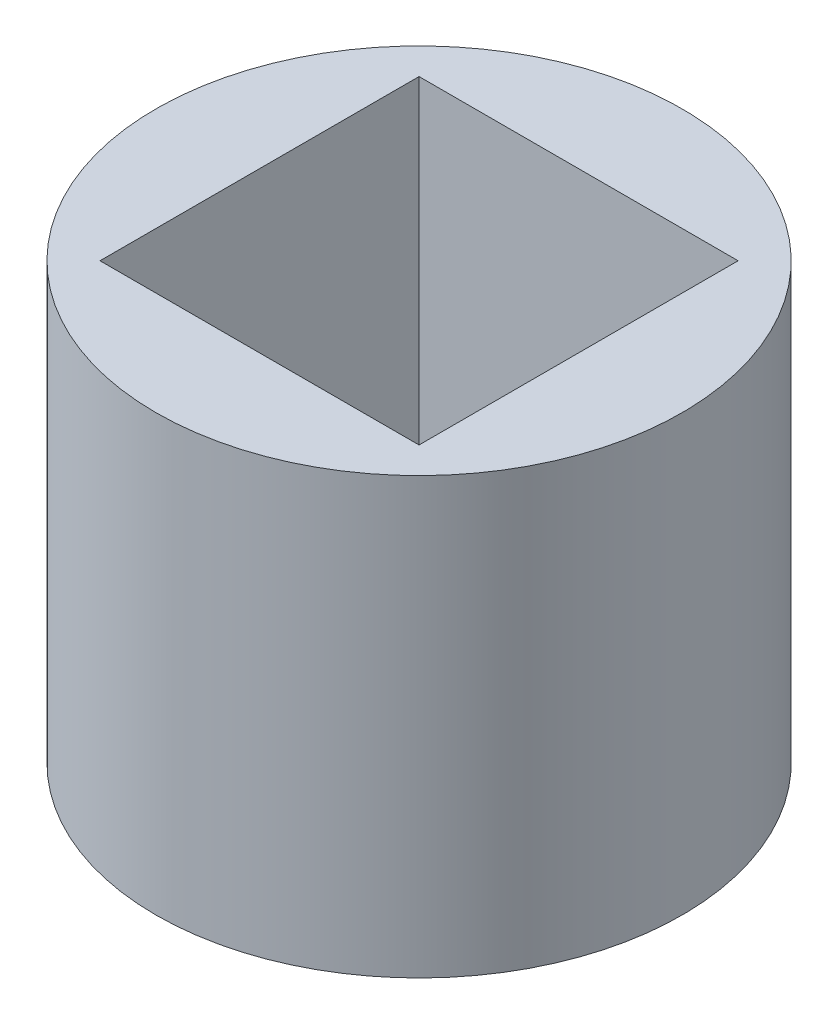
ISO-10303-21;
HEADER;
FILE_DESCRIPTION(('STEP AP214'),'2;1');
FILE_NAME('part.step','',(''),(''),'','','');
FILE_SCHEMA(('AUTOMOTIVE_DESIGN { 1 0 10303 214 1 1 1 1 }'));
ENDSEC;
DATA;
#1=APPLICATION_CONTEXT('core data for automotive mechanical design processes');
#2=APPLICATION_PROTOCOL_DEFINITION('international standard','automotive_design',2000,#1);
#3=PRODUCT_CONTEXT('',#1,'mechanical');
#4=PRODUCT('Part','Part','',(#3));
#5=PRODUCT_RELATED_PRODUCT_CATEGORY('part','',(#4));
#6=PRODUCT_DEFINITION_FORMATION('','',#4);
#7=PRODUCT_DEFINITION_CONTEXT('part definition',#1,'design');
#8=PRODUCT_DEFINITION('design','',#6,#7);
#9=PRODUCT_DEFINITION_SHAPE('','',#8);
#10=(LENGTH_UNIT() NAMED_UNIT(*) SI_UNIT(.MILLI.,.METRE.));
#11=(NAMED_UNIT(*) PLANE_ANGLE_UNIT() SI_UNIT($,.RADIAN.));
#12=(NAMED_UNIT(*) SI_UNIT($,.STERADIAN.) SOLID_ANGLE_UNIT());
#13=UNCERTAINTY_MEASURE_WITH_UNIT(LENGTH_MEASURE(1.E-05),#10,'distance_accuracy_value','');
#14=(GEOMETRIC_REPRESENTATION_CONTEXT(3) GLOBAL_UNCERTAINTY_ASSIGNED_CONTEXT((#13)) GLOBAL_UNIT_ASSIGNED_CONTEXT((#10,
#11,#12)) REPRESENTATION_CONTEXT('',''));
#15=CARTESIAN_POINT('',(0.,0.,0.));
#16=DIRECTION('',(0.,0.,1.));
#17=DIRECTION('',(1.,0.,0.));
#18=AXIS2_PLACEMENT_3D('',#15,#16,#17);
#19=CARTESIAN_POINT('',(0.,21.,0.));
#20=DIRECTION('',(0.,1.,0.));
#21=DIRECTION('',(0.,0.,1.));
#22=AXIS2_PLACEMENT_3D('',#19,#20,#21);
#23=PLANE('',#22);
#24=CARTESIAN_POINT('',(0.,21.,0.));
#25=DIRECTION('',(0.,1.,0.));
#26=DIRECTION('',(0.,0.,1.));
#27=AXIS2_PLACEMENT_3D('',#24,#25,#26);
#28=CIRCLE('',#27,12.7);
#29=CARTESIAN_POINT('',(0.,21.,12.7));
#30=VERTEX_POINT('',#29);
#31=EDGE_CURVE('E11',#30,#30,#28,.T.);
#32=ORIENTED_EDGE('',*,*,#31,.T.);
#33=EDGE_LOOP('',(#32));
#34=FACE_BOUND('',#33,.T.);
#35=DIRECTION('',(-1.,0.,0.));
#36=VECTOR('',#35,1.);
#37=CARTESIAN_POINT('',(-7.7,21.,-7.7));
#38=LINE('',#37,#36);
#39=CARTESIAN_POINT('',(7.7,21.,-7.7));
#40=VERTEX_POINT('',#39);
#41=CARTESIAN_POINT('',(-7.7,21.,-7.7));
#42=VERTEX_POINT('',#41);
#43=EDGE_CURVE('E90',#40,#42,#38,.T.);
#44=ORIENTED_EDGE('',*,*,#43,.F.);
#45=DIRECTION('',(0.,0.,-1.));
#46=VECTOR('',#45,1.);
#47=CARTESIAN_POINT('',(7.7,21.,-7.7));
#48=LINE('',#47,#46);
#49=CARTESIAN_POINT('',(7.7,21.,7.7));
#50=VERTEX_POINT('',#49);
#51=EDGE_CURVE('E81',#50,#40,#48,.T.);
#52=ORIENTED_EDGE('',*,*,#51,.F.);
#53=DIRECTION('',(1.,0.,0.));
#54=VECTOR('',#53,1.);
#55=CARTESIAN_POINT('',(-7.7,21.,7.7));
#56=LINE('',#55,#54);
#57=CARTESIAN_POINT('',(-7.7,21.,7.7));
#58=VERTEX_POINT('',#57);
#59=EDGE_CURVE('E106',#58,#50,#56,.T.);
#60=ORIENTED_EDGE('',*,*,#59,.F.);
#61=DIRECTION('',(0.,0.,1.));
#62=VECTOR('',#61,1.);
#63=CARTESIAN_POINT('',(-7.7,21.,-7.7));
#64=LINE('',#63,#62);
#65=EDGE_CURVE('E102',#42,#58,#64,.T.);
#66=ORIENTED_EDGE('',*,*,#65,.F.);
#67=EDGE_LOOP('',(#44,#52,#60,#66));
#68=FACE_BOUND('',#67,.T.);
#69=ADVANCED_FACE('F39',(#34,#68),#23,.T.);
#70=CARTESIAN_POINT('',(0.,0.,0.));
#71=DIRECTION('',(0.,1.,0.));
#72=DIRECTION('',(0.,0.,1.));
#73=AXIS2_PLACEMENT_3D('',#70,#71,#72);
#74=PLANE('',#73);
#75=CARTESIAN_POINT('',(0.,0.,0.));
#76=DIRECTION('',(0.,1.,0.));
#77=DIRECTION('',(0.,0.,1.));
#78=AXIS2_PLACEMENT_3D('',#75,#76,#77);
#79=CIRCLE('',#78,12.7);
#80=CARTESIAN_POINT('',(0.,0.,12.7));
#81=VERTEX_POINT('',#80);
#82=EDGE_CURVE('E43',#81,#81,#79,.T.);
#83=ORIENTED_EDGE('',*,*,#82,.F.);
#84=EDGE_LOOP('',(#83));
#85=FACE_BOUND('',#84,.T.);
#86=DIRECTION('',(0.,0.,-1.));
#87=VECTOR('',#86,1.);
#88=CARTESIAN_POINT('',(7.7,0.,-7.7));
#89=LINE('',#88,#87);
#90=CARTESIAN_POINT('',(7.7,0.,7.7));
#91=VERTEX_POINT('',#90);
#92=CARTESIAN_POINT('',(7.7,0.,-7.7));
#93=VERTEX_POINT('',#92);
#94=EDGE_CURVE('E63',#91,#93,#89,.T.);
#95=ORIENTED_EDGE('',*,*,#94,.T.);
#96=DIRECTION('',(-1.,0.,0.));
#97=VECTOR('',#96,1.);
#98=CARTESIAN_POINT('',(-7.7,0.,-7.7));
#99=LINE('',#98,#97);
#100=CARTESIAN_POINT('',(-7.7,0.,-7.7));
#101=VERTEX_POINT('',#100);
#102=EDGE_CURVE('E97',#93,#101,#99,.T.);
#103=ORIENTED_EDGE('',*,*,#102,.T.);
#104=DIRECTION('',(0.,0.,1.));
#105=VECTOR('',#104,1.);
#106=CARTESIAN_POINT('',(-7.7,0.,-7.7));
#107=LINE('',#106,#105);
#108=CARTESIAN_POINT('',(-7.7,0.,7.7));
#109=VERTEX_POINT('',#108);
#110=EDGE_CURVE('E115',#101,#109,#107,.T.);
#111=ORIENTED_EDGE('',*,*,#110,.T.);
#112=DIRECTION('',(1.,0.,0.));
#113=VECTOR('',#112,1.);
#114=CARTESIAN_POINT('',(-7.7,0.,7.7));
#115=LINE('',#114,#113);
#116=EDGE_CURVE('E91',#109,#91,#115,.T.);
#117=ORIENTED_EDGE('',*,*,#116,.T.);
#118=EDGE_LOOP('',(#95,#103,#111,#117));
#119=FACE_BOUND('',#118,.T.);
#120=ADVANCED_FACE('F131',(#85,#119),#74,.F.);
#121=CARTESIAN_POINT('',(0.,21.,0.));
#122=DIRECTION('',(0.,-1.,0.));
#123=DIRECTION('',(0.,0.,-1.));
#124=AXIS2_PLACEMENT_3D('',#121,#122,#123);
#125=CYLINDRICAL_SURFACE('',#124,12.7);
#126=ORIENTED_EDGE('',*,*,#31,.F.);
#127=EDGE_LOOP('',(#126));
#128=FACE_BOUND('',#127,.T.);
#129=ORIENTED_EDGE('',*,*,#82,.T.);
#130=EDGE_LOOP('',(#129));
#131=FACE_BOUND('',#130,.T.);
#132=ADVANCED_FACE('F41',(#128,#131),#125,.T.);
#133=CARTESIAN_POINT('',(7.7,21.,-7.7));
#134=DIRECTION('',(-1.,0.,0.));
#135=DIRECTION('',(0.,0.,1.));
#136=AXIS2_PLACEMENT_3D('',#133,#134,#135);
#137=PLANE('',#136);
#138=ORIENTED_EDGE('',*,*,#94,.F.);
#139=DIRECTION('',(0.,-1.,0.));
#140=VECTOR('',#139,1.);
#141=CARTESIAN_POINT('',(7.7,21.,7.7));
#142=LINE('',#141,#140);
#143=EDGE_CURVE('E85',#50,#91,#142,.T.);
#144=ORIENTED_EDGE('',*,*,#143,.F.);
#145=ORIENTED_EDGE('',*,*,#51,.T.);
#146=DIRECTION('',(0.,-1.,0.));
#147=VECTOR('',#146,1.);
#148=CARTESIAN_POINT('',(7.7,21.,-7.7));
#149=LINE('',#148,#147);
#150=EDGE_CURVE('E84',#40,#93,#149,.T.);
#151=ORIENTED_EDGE('',*,*,#150,.T.);
#152=EDGE_LOOP('',(#138,#144,#145,#151));
#153=FACE_BOUND('',#152,.T.);
#154=ADVANCED_FACE('F83',(#153),#137,.T.);
#155=CARTESIAN_POINT('',(-7.7,21.,-7.7));
#156=DIRECTION('',(0.,0.,1.));
#157=DIRECTION('',(1.,0.,0.));
#158=AXIS2_PLACEMENT_3D('',#155,#156,#157);
#159=PLANE('',#158);
#160=ORIENTED_EDGE('',*,*,#102,.F.);
#161=ORIENTED_EDGE('',*,*,#150,.F.);
#162=ORIENTED_EDGE('',*,*,#43,.T.);
#163=DIRECTION('',(0.,-1.,0.));
#164=VECTOR('',#163,1.);
#165=CARTESIAN_POINT('',(-7.7,21.,-7.7));
#166=LINE('',#165,#164);
#167=EDGE_CURVE('E99',#42,#101,#166,.T.);
#168=ORIENTED_EDGE('',*,*,#167,.T.);
#169=EDGE_LOOP('',(#160,#161,#162,#168));
#170=FACE_BOUND('',#169,.T.);
#171=ADVANCED_FACE('F94',(#170),#159,.T.);
#172=CARTESIAN_POINT('',(-7.7,21.,-7.7));
#173=DIRECTION('',(1.,0.,0.));
#174=DIRECTION('',(0.,0.,-1.));
#175=AXIS2_PLACEMENT_3D('',#172,#173,#174);
#176=PLANE('',#175);
#177=ORIENTED_EDGE('',*,*,#110,.F.);
#178=ORIENTED_EDGE('',*,*,#167,.F.);
#179=ORIENTED_EDGE('',*,*,#65,.T.);
#180=DIRECTION('',(0.,-1.,0.));
#181=VECTOR('',#180,1.);
#182=CARTESIAN_POINT('',(-7.7,21.,7.7));
#183=LINE('',#182,#181);
#184=EDGE_CURVE('E55',#58,#109,#183,.T.);
#185=ORIENTED_EDGE('',*,*,#184,.T.);
#186=EDGE_LOOP('',(#177,#178,#179,#185));
#187=FACE_BOUND('',#186,.T.);
#188=ADVANCED_FACE('F129',(#187),#176,.T.);
#189=CARTESIAN_POINT('',(-7.7,21.,7.7));
#190=DIRECTION('',(0.,0.,-1.));
#191=DIRECTION('',(-1.,0.,0.));
#192=AXIS2_PLACEMENT_3D('',#189,#190,#191);
#193=PLANE('',#192);
#194=ORIENTED_EDGE('',*,*,#116,.F.);
#195=ORIENTED_EDGE('',*,*,#184,.F.);
#196=ORIENTED_EDGE('',*,*,#59,.T.);
#197=ORIENTED_EDGE('',*,*,#143,.T.);
#198=EDGE_LOOP('',(#194,#195,#196,#197));
#199=FACE_BOUND('',#198,.T.);
#200=ADVANCED_FACE('F132',(#199),#193,.T.);
#201=CLOSED_SHELL('',(#69,#120,#132,#154,#171,#188,#200));
#202=MANIFOLD_SOLID_BREP('B2',#201);
#203=ADVANCED_BREP_SHAPE_REPRESENTATION('',(#18,#202),#14);
#204=SHAPE_DEFINITION_REPRESENTATION(#9,#203);
ENDSEC;
END-ISO-10303-21;
